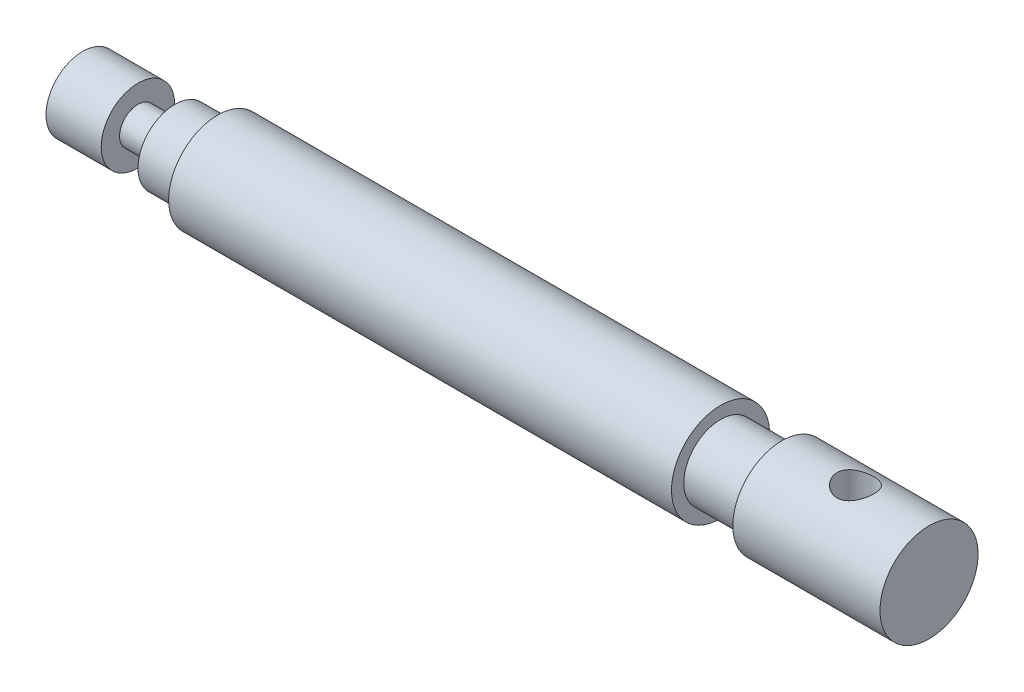
ISO-10303-21;
HEADER;
FILE_DESCRIPTION(('STEP AP214'),'2;1');
FILE_NAME('part.step','',(''),(''),'','','');
FILE_SCHEMA(('AUTOMOTIVE_DESIGN { 1 0 10303 214 1 1 1 1 }'));
ENDSEC;
DATA;
#1=APPLICATION_CONTEXT('core data for automotive mechanical design processes');
#2=APPLICATION_PROTOCOL_DEFINITION('international standard','automotive_design',2000,#1);
#3=PRODUCT_CONTEXT('',#1,'mechanical');
#4=PRODUCT('Part','Part','',(#3));
#5=PRODUCT_RELATED_PRODUCT_CATEGORY('part','',(#4));
#6=PRODUCT_DEFINITION_FORMATION('','',#4);
#7=PRODUCT_DEFINITION_CONTEXT('part definition',#1,'design');
#8=PRODUCT_DEFINITION('design','',#6,#7);
#9=PRODUCT_DEFINITION_SHAPE('','',#8);
#10=(LENGTH_UNIT() NAMED_UNIT(*) SI_UNIT(.MILLI.,.METRE.));
#11=(NAMED_UNIT(*) PLANE_ANGLE_UNIT() SI_UNIT($,.RADIAN.));
#12=(NAMED_UNIT(*) SI_UNIT($,.STERADIAN.) SOLID_ANGLE_UNIT());
#13=UNCERTAINTY_MEASURE_WITH_UNIT(LENGTH_MEASURE(1.E-05),#10,'distance_accuracy_value','');
#14=(GEOMETRIC_REPRESENTATION_CONTEXT(3) GLOBAL_UNCERTAINTY_ASSIGNED_CONTEXT((#13)) GLOBAL_UNIT_ASSIGNED_CONTEXT((#10,
#11,#12)) REPRESENTATION_CONTEXT('',''));
#15=CARTESIAN_POINT('',(0.,0.,0.));
#16=DIRECTION('',(0.,0.,1.));
#17=DIRECTION('',(1.,0.,0.));
#18=AXIS2_PLACEMENT_3D('',#15,#16,#17);
#19=CARTESIAN_POINT('',(-54.7718388429752,0.,0.));
#20=DIRECTION('',(1.,0.,0.));
#21=DIRECTION('',(0.,0.,-1.));
#22=AXIS2_PLACEMENT_3D('',#19,#20,#21);
#23=PLANE('',#22);
#24=CARTESIAN_POINT('',(-54.7718388429752,0.,0.));
#25=DIRECTION('',(-1.,0.,0.));
#26=DIRECTION('',(0.,0.,1.));
#27=AXIS2_PLACEMENT_3D('',#24,#25,#26);
#28=CIRCLE('',#27,6.);
#29=CARTESIAN_POINT('',(-54.7718388429752,0.,6.));
#30=VERTEX_POINT('',#29);
#31=EDGE_CURVE('E10',#30,#30,#28,.T.);
#32=ORIENTED_EDGE('',*,*,#31,.T.);
#33=EDGE_LOOP('',(#32));
#34=FACE_BOUND('',#33,.T.);
#35=ADVANCED_FACE('F37',(#34),#23,.F.);
#36=CARTESIAN_POINT('',(-54.7718388429752,0.,0.));
#37=DIRECTION('',(-1.,0.,0.));
#38=DIRECTION('',(0.,0.,1.));
#39=AXIS2_PLACEMENT_3D('',#36,#37,#38);
#40=CYLINDRICAL_SURFACE('',#39,6.);
#41=ORIENTED_EDGE('',*,*,#31,.F.);
#42=EDGE_LOOP('',(#41));
#43=FACE_BOUND('',#42,.T.);
#44=CARTESIAN_POINT('',(-45.7718388429752,0.,0.));
#45=DIRECTION('',(-1.,0.,0.));
#46=DIRECTION('',(0.,0.,1.));
#47=AXIS2_PLACEMENT_3D('',#44,#45,#46);
#48=CIRCLE('',#47,6.);
#49=CARTESIAN_POINT('',(-45.7718388429752,0.,6.));
#50=VERTEX_POINT('',#49);
#51=EDGE_CURVE('E44',#50,#50,#48,.T.);
#52=ORIENTED_EDGE('',*,*,#51,.T.);
#53=EDGE_LOOP('',(#52));
#54=FACE_BOUND('',#53,.T.);
#55=ADVANCED_FACE('F155',(#43,#54),#40,.T.);
#56=CARTESIAN_POINT('',(-45.7718388429752,0.,-6.));
#57=DIRECTION('',(-1.,0.,0.));
#58=DIRECTION('',(0.,0.,1.));
#59=AXIS2_PLACEMENT_3D('',#56,#57,#58);
#60=PLANE('',#59);
#61=ORIENTED_EDGE('',*,*,#51,.F.);
#62=EDGE_LOOP('',(#61));
#63=FACE_BOUND('',#62,.T.);
#64=CARTESIAN_POINT('',(-45.7718388429752,0.,0.));
#65=DIRECTION('',(-1.,0.,0.));
#66=DIRECTION('',(0.,0.,1.));
#67=AXIS2_PLACEMENT_3D('',#64,#65,#66);
#68=CIRCLE('',#67,3.);
#69=CARTESIAN_POINT('',(-45.7718388429752,0.,3.));
#70=VERTEX_POINT('',#69);
#71=EDGE_CURVE('E49',#70,#70,#68,.T.);
#72=ORIENTED_EDGE('',*,*,#71,.T.);
#73=EDGE_LOOP('',(#72));
#74=FACE_BOUND('',#73,.T.);
#75=ADVANCED_FACE('F152',(#63,#74),#60,.F.);
#76=CARTESIAN_POINT('',(-54.7718388429752,0.,0.));
#77=DIRECTION('',(-1.,0.,0.));
#78=DIRECTION('',(0.,0.,1.));
#79=AXIS2_PLACEMENT_3D('',#76,#77,#78);
#80=CYLINDRICAL_SURFACE('',#79,3.);
#81=ORIENTED_EDGE('',*,*,#71,.F.);
#82=EDGE_LOOP('',(#81));
#83=FACE_BOUND('',#82,.T.);
#84=CARTESIAN_POINT('',(-39.7718388429752,0.,0.));
#85=DIRECTION('',(-1.,0.,0.));
#86=DIRECTION('',(0.,0.,1.));
#87=AXIS2_PLACEMENT_3D('',#84,#85,#86);
#88=CIRCLE('',#87,3.);
#89=CARTESIAN_POINT('',(-39.7718388429752,0.,3.));
#90=VERTEX_POINT('',#89);
#91=EDGE_CURVE('E54',#90,#90,#88,.T.);
#92=ORIENTED_EDGE('',*,*,#91,.T.);
#93=EDGE_LOOP('',(#92));
#94=FACE_BOUND('',#93,.T.);
#95=ADVANCED_FACE('F148',(#83,#94),#80,.T.);
#96=CARTESIAN_POINT('',(-39.7718388429752,0.,-3.));
#97=DIRECTION('',(1.,0.,0.));
#98=DIRECTION('',(0.,0.,-1.));
#99=AXIS2_PLACEMENT_3D('',#96,#97,#98);
#100=PLANE('',#99);
#101=ORIENTED_EDGE('',*,*,#91,.F.);
#102=EDGE_LOOP('',(#101));
#103=FACE_BOUND('',#102,.T.);
#104=CARTESIAN_POINT('',(-39.7718388429752,0.,0.));
#105=DIRECTION('',(-1.,0.,0.));
#106=DIRECTION('',(0.,0.,1.));
#107=AXIS2_PLACEMENT_3D('',#104,#105,#106);
#108=CIRCLE('',#107,6.);
#109=CARTESIAN_POINT('',(-39.7718388429752,0.,6.));
#110=VERTEX_POINT('',#109);
#111=EDGE_CURVE('E60',#110,#110,#108,.T.);
#112=ORIENTED_EDGE('',*,*,#111,.T.);
#113=EDGE_LOOP('',(#112));
#114=FACE_BOUND('',#113,.T.);
#115=ADVANCED_FACE('F144',(#103,#114),#100,.F.);
#116=CARTESIAN_POINT('',(-54.7718388429752,0.,0.));
#117=DIRECTION('',(-1.,0.,0.));
#118=DIRECTION('',(0.,0.,1.));
#119=AXIS2_PLACEMENT_3D('',#116,#117,#118);
#120=CYLINDRICAL_SURFACE('',#119,6.);
#121=ORIENTED_EDGE('',*,*,#111,.F.);
#122=EDGE_LOOP('',(#121));
#123=FACE_BOUND('',#122,.T.);
#124=CARTESIAN_POINT('',(-32.7718388429752,0.,0.));
#125=DIRECTION('',(-1.,0.,0.));
#126=DIRECTION('',(0.,0.,1.));
#127=AXIS2_PLACEMENT_3D('',#124,#125,#126);
#128=CIRCLE('',#127,6.);
#129=CARTESIAN_POINT('',(-32.7718388429752,0.,6.));
#130=VERTEX_POINT('',#129);
#131=EDGE_CURVE('E64',#130,#130,#128,.T.);
#132=ORIENTED_EDGE('',*,*,#131,.T.);
#133=EDGE_LOOP('',(#132));
#134=FACE_BOUND('',#133,.T.);
#135=ADVANCED_FACE('F140',(#123,#134),#120,.T.);
#136=CARTESIAN_POINT('',(-32.7718388429752,0.,-6.));
#137=DIRECTION('',(1.,0.,0.));
#138=DIRECTION('',(0.,0.,-1.));
#139=AXIS2_PLACEMENT_3D('',#136,#137,#138);
#140=PLANE('',#139);
#141=ORIENTED_EDGE('',*,*,#131,.F.);
#142=EDGE_LOOP('',(#141));
#143=FACE_BOUND('',#142,.T.);
#144=CARTESIAN_POINT('',(-32.7718388429752,0.,0.));
#145=DIRECTION('',(-1.,0.,0.));
#146=DIRECTION('',(0.,0.,1.));
#147=AXIS2_PLACEMENT_3D('',#144,#145,#146);
#148=CIRCLE('',#147,8.);
#149=CARTESIAN_POINT('',(-32.7718388429752,0.,8.));
#150=VERTEX_POINT('',#149);
#151=EDGE_CURVE('E68',#150,#150,#148,.T.);
#152=ORIENTED_EDGE('',*,*,#151,.T.);
#153=EDGE_LOOP('',(#152));
#154=FACE_BOUND('',#153,.T.);
#155=ADVANCED_FACE('F136',(#143,#154),#140,.F.);
#156=CARTESIAN_POINT('',(-54.7718388429752,0.,0.));
#157=DIRECTION('',(-1.,0.,0.));
#158=DIRECTION('',(0.,0.,1.));
#159=AXIS2_PLACEMENT_3D('',#156,#157,#158);
#160=CYLINDRICAL_SURFACE('',#159,8.);
#161=ORIENTED_EDGE('',*,*,#151,.F.);
#162=EDGE_LOOP('',(#161));
#163=FACE_BOUND('',#162,.T.);
#164=CARTESIAN_POINT('',(49.2281611570248,0.,0.));
#165=DIRECTION('',(-1.,0.,0.));
#166=DIRECTION('',(0.,0.,1.));
#167=AXIS2_PLACEMENT_3D('',#164,#165,#166);
#168=CIRCLE('',#167,8.);
#169=CARTESIAN_POINT('',(49.2281611570248,0.,8.));
#170=VERTEX_POINT('',#169);
#171=EDGE_CURVE('E72',#170,#170,#168,.T.);
#172=ORIENTED_EDGE('',*,*,#171,.T.);
#173=EDGE_LOOP('',(#172));
#174=FACE_BOUND('',#173,.T.);
#175=ADVANCED_FACE('F132',(#163,#174),#160,.T.);
#176=CARTESIAN_POINT('',(49.2281611570248,0.,-8.));
#177=DIRECTION('',(-1.,0.,0.));
#178=DIRECTION('',(0.,0.,1.));
#179=AXIS2_PLACEMENT_3D('',#176,#177,#178);
#180=PLANE('',#179);
#181=ORIENTED_EDGE('',*,*,#171,.F.);
#182=EDGE_LOOP('',(#181));
#183=FACE_BOUND('',#182,.T.);
#184=CARTESIAN_POINT('',(49.2281611570248,0.,0.));
#185=DIRECTION('',(-1.,0.,0.));
#186=DIRECTION('',(0.,0.,1.));
#187=AXIS2_PLACEMENT_3D('',#184,#185,#186);
#188=CIRCLE('',#187,6.);
#189=CARTESIAN_POINT('',(49.2281611570248,0.,6.));
#190=VERTEX_POINT('',#189);
#191=EDGE_CURVE('E76',#190,#190,#188,.T.);
#192=ORIENTED_EDGE('',*,*,#191,.T.);
#193=EDGE_LOOP('',(#192));
#194=FACE_BOUND('',#193,.T.);
#195=ADVANCED_FACE('F128',(#183,#194),#180,.F.);
#196=CARTESIAN_POINT('',(-54.7718388429752,0.,0.));
#197=DIRECTION('',(-1.,0.,0.));
#198=DIRECTION('',(0.,0.,1.));
#199=AXIS2_PLACEMENT_3D('',#196,#197,#198);
#200=CYLINDRICAL_SURFACE('',#199,6.);
#201=ORIENTED_EDGE('',*,*,#191,.F.);
#202=EDGE_LOOP('',(#201));
#203=FACE_BOUND('',#202,.T.);
#204=CARTESIAN_POINT('',(59.2281611570248,0.,0.));
#205=DIRECTION('',(-1.,0.,0.));
#206=DIRECTION('',(0.,0.,1.));
#207=AXIS2_PLACEMENT_3D('',#204,#205,#206);
#208=CIRCLE('',#207,6.);
#209=CARTESIAN_POINT('',(59.2281611570248,0.,6.));
#210=VERTEX_POINT('',#209);
#211=EDGE_CURVE('E80',#210,#210,#208,.T.);
#212=ORIENTED_EDGE('',*,*,#211,.T.);
#213=EDGE_LOOP('',(#212));
#214=FACE_BOUND('',#213,.T.);
#215=ADVANCED_FACE('F124',(#203,#214),#200,.T.);
#216=CARTESIAN_POINT('',(59.2281611570248,0.,-6.));
#217=DIRECTION('',(1.,0.,0.));
#218=DIRECTION('',(0.,0.,-1.));
#219=AXIS2_PLACEMENT_3D('',#216,#217,#218);
#220=PLANE('',#219);
#221=ORIENTED_EDGE('',*,*,#211,.F.);
#222=EDGE_LOOP('',(#221));
#223=FACE_BOUND('',#222,.T.);
#224=CARTESIAN_POINT('',(59.2281611570248,0.,0.));
#225=DIRECTION('',(-1.,0.,0.));
#226=DIRECTION('',(0.,0.,1.));
#227=AXIS2_PLACEMENT_3D('',#224,#225,#226);
#228=CIRCLE('',#227,8.);
#229=CARTESIAN_POINT('',(59.2281611570248,0.,8.));
#230=VERTEX_POINT('',#229);
#231=EDGE_CURVE('E84',#230,#230,#228,.T.);
#232=ORIENTED_EDGE('',*,*,#231,.T.);
#233=EDGE_LOOP('',(#232));
#234=FACE_BOUND('',#233,.T.);
#235=ADVANCED_FACE('F120',(#223,#234),#220,.F.);
#236=CARTESIAN_POINT('',(-54.7718388429752,0.,0.));
#237=DIRECTION('',(-1.,0.,0.));
#238=DIRECTION('',(0.,0.,1.));
#239=AXIS2_PLACEMENT_3D('',#236,#237,#238);
#240=CYLINDRICAL_SURFACE('',#239,8.);
#241=CARTESIAN_POINT('',(71.2281611570248,-7.41619848709566,3.00000000000001));
#242=CARTESIAN_POINT('',(71.0661461895414,-7.41619281215226,3.00000608211288));
#243=CARTESIAN_POINT('',(70.9041713118986,-7.42156520296313,2.98683195095365));
#244=CARTESIAN_POINT('',(70.5851049910896,-7.44232318425765,2.93472375787484));
#245=CARTESIAN_POINT('',(70.4280134018131,-7.45770847484803,2.89579046745933));
#246=CARTESIAN_POINT('',(70.123410413836,-7.49650960610891,2.79379315222298));
#247=CARTESIAN_POINT('',(69.9758770437329,-7.51990619151695,2.73078694533006));
#248=CARTESIAN_POINT('',(69.6934173633768,-7.57206268400017,2.58263713485087));
#249=CARTESIAN_POINT('',(69.5584948564569,-7.60082420131042,2.49748688189993));
#250=CARTESIAN_POINT('',(69.2983805337821,-7.66207149335192,2.30293322748412));
#251=CARTESIAN_POINT('',(69.1739040977668,-7.69466683848217,2.19260762426636));
#252=CARTESIAN_POINT('',(68.944715527681,-7.75899501256083,1.95279167955762));
#253=CARTESIAN_POINT('',(68.8400076095408,-7.79072765629295,1.8232972605133));
#254=CARTESIAN_POINT('',(68.6498821324338,-7.8510574787339,1.54338931035527));
#255=CARTESIAN_POINT('',(68.5652422075931,-7.87951122447086,1.39241389507608));
#256=CARTESIAN_POINT('',(68.4228588119749,-7.92876015947619,1.07711154393048));
#257=CARTESIAN_POINT('',(68.3651060130408,-7.94955800433994,0.912789261867071));
#258=CARTESIAN_POINT('',(68.2806453654756,-7.98037394206897,0.582978683353673));
#259=CARTESIAN_POINT('',(68.2527059021439,-7.99081830429549,0.417846394563201));
#260=CARTESIAN_POINT('',(68.2247187551348,-8.0012802821588,0.0849287275895712));
#261=CARTESIAN_POINT('',(68.2246620017874,-8.0013012882982,-0.0828557701256755));
#262=CARTESIAN_POINT('',(68.2517246799551,-7.99118531807774,-0.407487086128935));
#263=CARTESIAN_POINT('',(68.2774997529223,-7.98155083993307,-0.564464356533751));
#264=CARTESIAN_POINT('',(68.3532329874759,-7.95386549864585,-0.871678435968826));
#265=CARTESIAN_POINT('',(68.4031928615491,-7.93581403951378,-1.02191476686077));
#266=CARTESIAN_POINT('',(68.5265020603762,-7.89275538334835,-1.31397803460604));
#267=CARTESIAN_POINT('',(68.6001811675606,-7.86765078939303,-1.45565078457397));
#268=CARTESIAN_POINT('',(68.7685453508846,-7.81302620451409,-1.72497321591576));
#269=CARTESIAN_POINT('',(68.8632372030638,-7.78350479028858,-1.85261835386705));
#270=CARTESIAN_POINT('',(69.0774157295871,-7.72105059308269,-2.09818097359933));
#271=CARTESIAN_POINT('',(69.1980289883101,-7.68801927514871,-2.21509229051721));
#272=CARTESIAN_POINT('',(69.4573471436834,-7.62364921304341,-2.42740791139661));
#273=CARTESIAN_POINT('',(69.5960565702562,-7.59231089545926,-2.52280681389449));
#274=CARTESIAN_POINT('',(69.8916000919021,-7.53425406951149,-2.69131223613209));
#275=CARTESIAN_POINT('',(70.0487681441962,-7.50765354114235,-2.76387695690678));
#276=CARTESIAN_POINT('',(70.3743536071526,-7.4634487707231,-2.88112928869848));
#277=CARTESIAN_POINT('',(70.5427647001505,-7.44583952363152,-2.925832412077));
#278=CARTESIAN_POINT('',(70.8761130817003,-7.4227919449154,-2.98380383422379));
#279=CARTESIAN_POINT('',(71.0407293681087,-7.41673570495336,-2.99867042318746));
#280=CARTESIAN_POINT('',(71.3701798704966,-7.41573079037772,-3.00115771271731));
#281=CARTESIAN_POINT('',(71.5350140217267,-7.42077934004762,-2.98878522187311));
#282=CARTESIAN_POINT('',(71.852021001603,-7.44078763262528,-2.93859467040517));
#283=CARTESIAN_POINT('',(72.0044234285549,-7.45526552433718,-2.90201236668504));
#284=CARTESIAN_POINT('',(72.3008570464644,-7.49192974091902,-2.80599549281221));
#285=CARTESIAN_POINT('',(72.4448865153608,-7.51411764500121,-2.74655624069232));
#286=CARTESIAN_POINT('',(72.7264900331774,-7.56472486232391,-2.60400584550571));
#287=CARTESIAN_POINT('',(72.8636197412995,-7.59334657784192,-2.52009090354098));
#288=CARTESIAN_POINT('',(73.1224191204768,-7.6532562858852,-2.33182635724955));
#289=CARTESIAN_POINT('',(73.244083106274,-7.68454525188137,-2.22746927392869));
#290=CARTESIAN_POINT('',(73.476497903415,-7.74866093106386,-1.99345468180189));
#291=CARTESIAN_POINT('',(73.5860679745623,-7.7814593871406,-1.86261268298212));
#292=CARTESIAN_POINT('',(73.7818378922037,-7.84299749926599,-1.58359494350629));
#293=CARTESIAN_POINT('',(73.8680376629165,-7.87173714215327,-1.43541914664534));
#294=CARTESIAN_POINT('',(74.014053269424,-7.92189971409105,-1.12603265893695));
#295=CARTESIAN_POINT('',(74.07395940461,-7.9433476267602,-0.964868866129252));
#296=CARTESIAN_POINT('',(74.1654739847246,-7.97658873425142,-0.633763775046511));
#297=CARTESIAN_POINT('',(74.1970957278696,-7.98838646598825,-0.46382664144719));
#298=CARTESIAN_POINT('',(74.2297099625344,-8.00056814634147,-0.130671170547637));
#299=CARTESIAN_POINT('',(74.2323801231428,-8.00157721907528,0.0323615361216852));
#300=CARTESIAN_POINT('',(74.211330838134,-7.99369779618447,0.356453572824844));
#301=CARTESIAN_POINT('',(74.1876145752531,-7.98481049426262,0.517513138490512));
#302=CARTESIAN_POINT('',(74.1156434540376,-7.95842179207541,0.829096496754251));
#303=CARTESIAN_POINT('',(74.0680013452681,-7.9411358275603,0.979781462137668));
#304=CARTESIAN_POINT('',(73.9501411302561,-7.89975567241984,1.27103094601278));
#305=CARTESIAN_POINT('',(73.8799187504153,-7.87566019311345,1.41159354255109));
#306=CARTESIAN_POINT('',(73.7155332700152,-7.8218123660013,1.68508035398882));
#307=CARTESIAN_POINT('',(73.6204878759965,-7.79186480217587,1.81743509769369));
#308=CARTESIAN_POINT('',(73.4105454966496,-7.72999015389759,2.06483469504674));
#309=CARTESIAN_POINT('',(73.2956414254092,-7.69806236548316,2.17987334251185));
#310=CARTESIAN_POINT('',(73.0420328937346,-7.63376259478074,2.39562428472387));
#311=CARTESIAN_POINT('',(72.9023923527157,-7.60145610697262,2.49525999632032));
#312=CARTESIAN_POINT('',(72.6073294178786,-7.54196650008334,2.66969419113706));
#313=CARTESIAN_POINT('',(72.4519053889195,-7.51478391266386,2.74449009756385));
#314=CARTESIAN_POINT('',(72.1222497950722,-7.46804539702405,2.86931773948449));
#315=CARTESIAN_POINT('',(71.9474924239943,-7.44887606566002,2.91812005798768));
#316=CARTESIAN_POINT('',(71.59119061312,-7.42295988688336,2.98344713444438));
#317=CARTESIAN_POINT('',(71.4096507316304,-7.41620484418155,2.99999318680185));
#318=CARTESIAN_POINT('',(71.2281611570248,-7.41619848709566,3.00000000000001));
#319=B_SPLINE_CURVE_WITH_KNOTS('',3,(#241,#242,#243,#244,#245,#246,#247,#248,#249,#250,#251,
#252,#253,#254,#255,#256,#257,#258,#259,#260,#261,#262,#263,#264,#265,#266,#267,#268,#269,#270,
#271,#272,#273,#274,#275,#276,#277,#278,#279,#280,#281,#282,#283,#284,#285,#286,#287,#288,#289,
#290,#291,#292,#293,#294,#295,#296,#297,#298,#299,#300,#301,#302,#303,#304,#305,#306,#307,#308,
#309,#310,#311,#312,#313,#314,#315,#316,#317,#318),.UNSPECIFIED.,.T.,.F.,(4,2,2,2,2,2,2,2,2,2,2,
2,2,2,2,2,2,2,2,2,2,2,2,2,2,2,2,2,2,2,2,2,2,2,2,2,2,2,4),(0.,0.485369082889289,
0.970723629307669,1.45491971362402,1.93926135947585,2.44549304813253,2.95183257656963,
3.47540144283839,3.99878852773657,4.49960036990355,5.00024930820711,5.47612945617385,
5.95204330537668,6.43488262432333,6.91787787268948,7.42913350142747,7.94051735665667,
8.46325184520836,8.98569503290591,9.47931315500613,9.97280790797413,10.4428769187604,
10.913042268787,11.4008312203129,11.8887989695235,12.4077003400689,12.9266033932,
13.4437101779998,13.960573711399,14.4473144111952,14.933996406586,15.4088054802743,
15.8837044704531,16.3785664737362,16.8736054180957,17.394771991038,17.9159926110813,
18.460063577615,19.0037752466575),.UNSPECIFIED.);
#320=CARTESIAN_POINT('',(71.2281611570248,-7.41619848709566,3.00000000000001));
#321=VERTEX_POINT('',#320);
#322=EDGE_CURVE('E92',#321,#321,#319,.T.);
#323=ORIENTED_EDGE('',*,*,#322,.F.);
#324=EDGE_LOOP('',(#323));
#325=FACE_BOUND('',#324,.T.);
#326=CARTESIAN_POINT('',(71.2281611570248,7.41619848709566,3.00000000000001));
#327=CARTESIAN_POINT('',(71.3901761245082,7.41619281215226,3.00000608211288));
#328=CARTESIAN_POINT('',(71.552151002151,7.42156520296313,2.98683195095365));
#329=CARTESIAN_POINT('',(71.87121732296,7.44232318425765,2.93472375787484));
#330=CARTESIAN_POINT('',(72.0283089122365,7.45770847484803,2.89579046745933));
#331=CARTESIAN_POINT('',(72.3329119002136,7.49650960610891,2.79379315222298));
#332=CARTESIAN_POINT('',(72.4804452703167,7.51990619151695,2.73078694533006));
#333=CARTESIAN_POINT('',(72.7629049506727,7.57206268400017,2.58263713485087));
#334=CARTESIAN_POINT('',(72.8978274575926,7.60082420131042,2.49748688189993));
#335=CARTESIAN_POINT('',(73.1579417802675,7.66207149335192,2.30293322748412));
#336=CARTESIAN_POINT('',(73.2824182162828,7.69466683848217,2.19260762426636));
#337=CARTESIAN_POINT('',(73.5116067863686,7.75899501256083,1.95279167955762));
#338=CARTESIAN_POINT('',(73.6163147045087,7.79072765629295,1.8232972605133));
#339=CARTESIAN_POINT('',(73.8064401816158,7.8510574787339,1.54338931035527));
#340=CARTESIAN_POINT('',(73.8910801064565,7.87951122447086,1.39241389507608));
#341=CARTESIAN_POINT('',(74.0334635020747,7.92876015947619,1.07711154393048));
#342=CARTESIAN_POINT('',(74.0912163010087,7.94955800433994,0.912789261867071));
#343=CARTESIAN_POINT('',(74.175676948574,7.98037394206897,0.582978683353673));
#344=CARTESIAN_POINT('',(74.2036164119057,7.99081830429549,0.417846394563201));
#345=CARTESIAN_POINT('',(74.2316035589148,8.0012802821588,0.0849287275895712));
#346=CARTESIAN_POINT('',(74.2316603122622,8.0013012882982,-0.0828557701256755));
#347=CARTESIAN_POINT('',(74.2045976340945,7.99118531807774,-0.407487086128935));
#348=CARTESIAN_POINT('',(74.1788225611272,7.98155083993307,-0.564464356533751));
#349=CARTESIAN_POINT('',(74.1030893265736,7.95386549864585,-0.871678435968826));
#350=CARTESIAN_POINT('',(74.0531294525004,7.93581403951378,-1.02191476686077));
#351=CARTESIAN_POINT('',(73.9298202536734,7.89275538334835,-1.31397803460604));
#352=CARTESIAN_POINT('',(73.856141146489,7.86765078939303,-1.45565078457397));
#353=CARTESIAN_POINT('',(73.687776963165,7.81302620451409,-1.72497321591576));
#354=CARTESIAN_POINT('',(73.5930851109858,7.78350479028858,-1.85261835386705));
#355=CARTESIAN_POINT('',(73.3789065844625,7.72105059308269,-2.09818097359933));
#356=CARTESIAN_POINT('',(73.2582933257395,7.68801927514871,-2.21509229051721));
#357=CARTESIAN_POINT('',(72.9989751703661,7.62364921304341,-2.42740791139661));
#358=CARTESIAN_POINT('',(72.8602657437934,7.59231089545926,-2.52280681389449));
#359=CARTESIAN_POINT('',(72.5647222221474,7.53425406951149,-2.69131223613209));
#360=CARTESIAN_POINT('',(72.4075541698533,7.50765354114235,-2.76387695690677));
#361=CARTESIAN_POINT('',(72.081968706897,7.4634487707231,-2.88112928869848));
#362=CARTESIAN_POINT('',(71.9135576138991,7.44583952363152,-2.925832412077));
#363=CARTESIAN_POINT('',(71.5802092323493,7.4227919449154,-2.98380383422379));
#364=CARTESIAN_POINT('',(71.4155929459408,7.41673570495336,-2.99867042318746));
#365=CARTESIAN_POINT('',(71.0861424435529,7.41573079037772,-3.00115771271731));
#366=CARTESIAN_POINT('',(70.9213082923229,7.42077934004762,-2.98878522187311));
#367=CARTESIAN_POINT('',(70.6043013124465,7.44078763262528,-2.93859467040517));
#368=CARTESIAN_POINT('',(70.4518988854947,7.45526552433718,-2.90201236668504));
#369=CARTESIAN_POINT('',(70.1554652675852,7.49192974091902,-2.80599549281221));
#370=CARTESIAN_POINT('',(70.0114357986887,7.51411764500121,-2.74655624069232));
#371=CARTESIAN_POINT('',(69.7298322808721,7.56472486232391,-2.60400584550571));
#372=CARTESIAN_POINT('',(69.59270257275,7.59334657784192,-2.52009090354098));
#373=CARTESIAN_POINT('',(69.3339031935728,7.6532562858852,-2.33182635724955));
#374=CARTESIAN_POINT('',(69.2122392077755,7.68454525188137,-2.22746927392869));
#375=CARTESIAN_POINT('',(68.9798244106346,7.74866093106386,-1.99345468180189));
#376=CARTESIAN_POINT('',(68.8702543394873,7.7814593871406,-1.86261268298213));
#377=CARTESIAN_POINT('',(68.6744844218459,7.84299749926599,-1.5835949435063));
#378=CARTESIAN_POINT('',(68.5882846511331,7.87173714215327,-1.43541914664534));
#379=CARTESIAN_POINT('',(68.4422690446255,7.92189971409105,-1.12603265893695));
#380=CARTESIAN_POINT('',(68.3823629094396,7.9433476267602,-0.964868866129252));
#381=CARTESIAN_POINT('',(68.2908483293249,7.97658873425142,-0.633763775046511));
#382=CARTESIAN_POINT('',(68.25922658618,7.98838646598825,-0.46382664144719));
#383=CARTESIAN_POINT('',(68.2266123515151,8.00056814634147,-0.130671170547637));
#384=CARTESIAN_POINT('',(68.2239421909068,8.00157721907528,0.0323615361216852));
#385=CARTESIAN_POINT('',(68.2449914759156,7.99369779618447,0.356453572824844));
#386=CARTESIAN_POINT('',(68.2687077387965,7.98481049426262,0.517513138490512));
#387=CARTESIAN_POINT('',(68.340678860012,7.95842179207541,0.829096496754251));
#388=CARTESIAN_POINT('',(68.3883209687815,7.9411358275603,0.979781462137668));
#389=CARTESIAN_POINT('',(68.5061811837935,7.89975567241984,1.27103094601278));
#390=CARTESIAN_POINT('',(68.5764035636343,7.87566019311345,1.41159354255109));
#391=CARTESIAN_POINT('',(68.7407890440344,7.8218123660013,1.68508035398882));
#392=CARTESIAN_POINT('',(68.8358344380531,7.79186480217587,1.81743509769369));
#393=CARTESIAN_POINT('',(69.0457768173999,7.72999015389759,2.06483469504674));
#394=CARTESIAN_POINT('',(69.1606808886404,7.69806236548316,2.17987334251185));
#395=CARTESIAN_POINT('',(69.414289420315,7.63376259478074,2.39562428472387));
#396=CARTESIAN_POINT('',(69.5539299613339,7.60145610697262,2.49525999632032));
#397=CARTESIAN_POINT('',(69.848992896171,7.54196650008334,2.66969419113706));
#398=CARTESIAN_POINT('',(70.00441692513,7.51478391266386,2.74449009756385));
#399=CARTESIAN_POINT('',(70.3340725189774,7.46804539702406,2.86931773948448));
#400=CARTESIAN_POINT('',(70.5088298900552,7.44887606566003,2.91812005798767));
#401=CARTESIAN_POINT('',(70.8651317009295,7.42295988688336,2.98344713444438));
#402=CARTESIAN_POINT('',(71.0466715824192,7.41620484418155,2.99999318680185));
#403=CARTESIAN_POINT('',(71.2281611570248,7.41619848709566,3.00000000000001));
#404=B_SPLINE_CURVE_WITH_KNOTS('',3,(#326,#327,#328,#329,#330,#331,#332,#333,#334,#335,#336,
#337,#338,#339,#340,#341,#342,#343,#344,#345,#346,#347,#348,#349,#350,#351,#352,#353,#354,#355,
#356,#357,#358,#359,#360,#361,#362,#363,#364,#365,#366,#367,#368,#369,#370,#371,#372,#373,#374,
#375,#376,#377,#378,#379,#380,#381,#382,#383,#384,#385,#386,#387,#388,#389,#390,#391,#392,#393,
#394,#395,#396,#397,#398,#399,#400,#401,#402,#403),.UNSPECIFIED.,.T.,.F.,(4,2,2,2,2,2,2,2,2,2,2,
2,2,2,2,2,2,2,2,2,2,2,2,2,2,2,2,2,2,2,2,2,2,2,2,2,2,2,4),(0.,0.485369082889289,
0.970723629307669,1.45491971362402,1.93926135947585,2.44549304813253,2.95183257656963,
3.47540144283839,3.99878852773657,4.49960036990355,5.00024930820711,5.47612945617385,
5.95204330537668,6.43488262432333,6.91787787268948,7.42913350142747,7.94051735665667,
8.46325184520835,8.98569503290591,9.47931315500613,9.97280790797413,10.4428769187604,
10.913042268787,11.4008312203129,11.8887989695235,12.4077003400689,12.9266033932,
13.4437101779998,13.960573711399,14.4473144111952,14.933996406586,15.4088054802743,
15.8837044704531,16.3785664737362,16.8736054180957,17.394771991038,17.9159926110813,
18.460063577615,19.0037752466575),.UNSPECIFIED.);
#405=CARTESIAN_POINT('',(71.2281611570248,7.41619848709566,3.00000000000001));
#406=VERTEX_POINT('',#405);
#407=EDGE_CURVE('E101',#406,#406,#404,.T.);
#408=ORIENTED_EDGE('',*,*,#407,.F.);
#409=EDGE_LOOP('',(#408));
#410=FACE_BOUND('',#409,.T.);
#411=ORIENTED_EDGE('',*,*,#231,.F.);
#412=EDGE_LOOP('',(#411));
#413=FACE_BOUND('',#412,.T.);
#414=CARTESIAN_POINT('',(83.2281611570248,0.,0.));
#415=DIRECTION('',(-1.,0.,0.));
#416=DIRECTION('',(0.,0.,1.));
#417=AXIS2_PLACEMENT_3D('',#414,#415,#416);
#418=CIRCLE('',#417,8.);
#419=CARTESIAN_POINT('',(83.2281611570248,0.,8.));
#420=VERTEX_POINT('',#419);
#421=EDGE_CURVE('E88',#420,#420,#418,.T.);
#422=ORIENTED_EDGE('',*,*,#421,.T.);
#423=EDGE_LOOP('',(#422));
#424=FACE_BOUND('',#423,.T.);
#425=ADVANCED_FACE('F116',(#325,#410,#413,#424),#240,.T.);
#426=CARTESIAN_POINT('',(83.2281611570248,0.,-8.));
#427=DIRECTION('',(-1.,0.,0.));
#428=DIRECTION('',(0.,0.,1.));
#429=AXIS2_PLACEMENT_3D('',#426,#427,#428);
#430=PLANE('',#429);
#431=ORIENTED_EDGE('',*,*,#421,.F.);
#432=EDGE_LOOP('',(#431));
#433=FACE_BOUND('',#432,.T.);
#434=ADVANCED_FACE('F111',(#433),#430,.F.);
#435=CARTESIAN_POINT('',(71.2281611570248,-8.001,0.));
#436=DIRECTION('',(0.,1.,0.));
#437=DIRECTION('',(0.,0.,1.));
#438=AXIS2_PLACEMENT_3D('',#435,#436,#437);
#439=CYLINDRICAL_SURFACE('',#438,3.00000000000001);
#440=ORIENTED_EDGE('',*,*,#407,.T.);
#441=EDGE_LOOP('',(#440));
#442=FACE_BOUND('',#441,.T.);
#443=ORIENTED_EDGE('',*,*,#322,.T.);
#444=EDGE_LOOP('',(#443));
#445=FACE_BOUND('',#444,.T.);
#446=ADVANCED_FACE('F105',(#442,#445),#439,.F.);
#447=CLOSED_SHELL('',(#35,#55,#75,#95,#115,#135,#155,#175,#195,#215,#235,#425,#434,#446));
#448=MANIFOLD_SOLID_BREP('B2',#447);
#449=ADVANCED_BREP_SHAPE_REPRESENTATION('',(#18,#448),#14);
#450=SHAPE_DEFINITION_REPRESENTATION(#9,#449);
ENDSEC;
END-ISO-10303-21;
